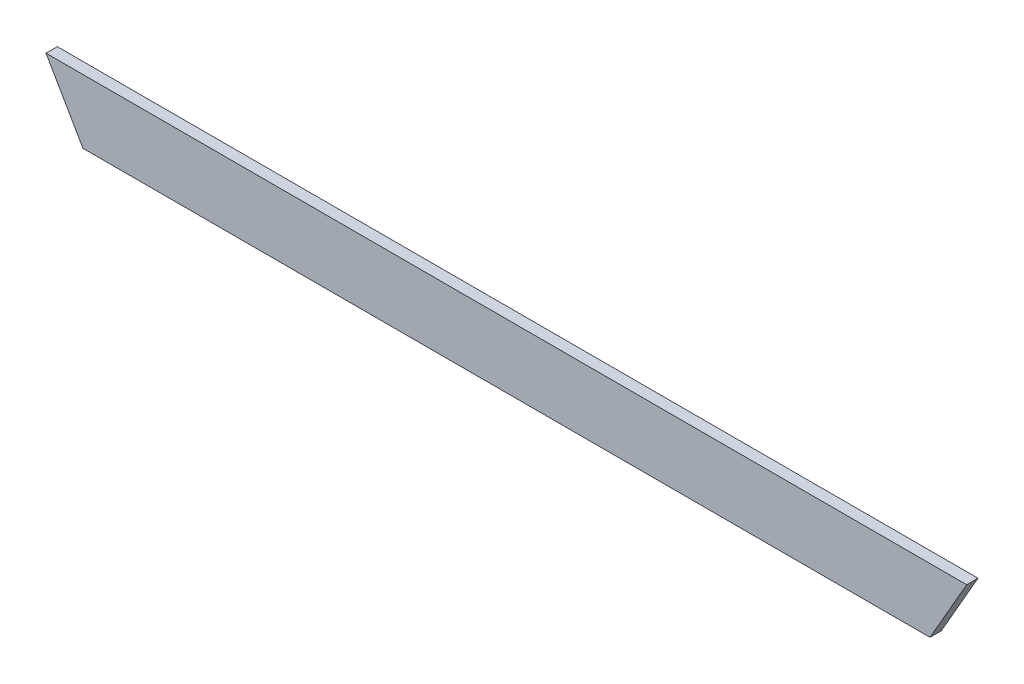
ISO-10303-21;
HEADER;
FILE_DESCRIPTION(('STEP AP214'),'2;1');
FILE_NAME('part.step','',(''),(''),'','','');
FILE_SCHEMA(('AUTOMOTIVE_DESIGN { 1 0 10303 214 1 1 1 1 }'));
ENDSEC;
DATA;
#1=APPLICATION_CONTEXT('core data for automotive mechanical design processes');
#2=APPLICATION_PROTOCOL_DEFINITION('international standard','automotive_design',2000,#1);
#3=PRODUCT_CONTEXT('',#1,'mechanical');
#4=PRODUCT('Part','Part','',(#3));
#5=PRODUCT_RELATED_PRODUCT_CATEGORY('part','',(#4));
#6=PRODUCT_DEFINITION_FORMATION('','',#4);
#7=PRODUCT_DEFINITION_CONTEXT('part definition',#1,'design');
#8=PRODUCT_DEFINITION('design','',#6,#7);
#9=PRODUCT_DEFINITION_SHAPE('','',#8);
#10=(LENGTH_UNIT() NAMED_UNIT(*) SI_UNIT(.MILLI.,.METRE.));
#11=(NAMED_UNIT(*) PLANE_ANGLE_UNIT() SI_UNIT($,.RADIAN.));
#12=(NAMED_UNIT(*) SI_UNIT($,.STERADIAN.) SOLID_ANGLE_UNIT());
#13=UNCERTAINTY_MEASURE_WITH_UNIT(LENGTH_MEASURE(1.E-05),#10,'distance_accuracy_value','');
#14=(GEOMETRIC_REPRESENTATION_CONTEXT(3) GLOBAL_UNCERTAINTY_ASSIGNED_CONTEXT((#13)) GLOBAL_UNIT_ASSIGNED_CONTEXT((#10,
#11,#12)) REPRESENTATION_CONTEXT('',''));
#15=CARTESIAN_POINT('',(0.,0.,0.));
#16=DIRECTION('',(0.,0.,1.));
#17=DIRECTION('',(1.,0.,0.));
#18=AXIS2_PLACEMENT_3D('',#15,#16,#17);
#19=CARTESIAN_POINT('',(-660.185020783291,130.622118766259,3.));
#20=DIRECTION('',(0.,-1.,0.));
#21=DIRECTION('',(1.,0.,0.));
#22=AXIS2_PLACEMENT_3D('',#19,#20,#21);
#23=PLANE('',#22);
#24=DIRECTION('',(-1.,0.,0.));
#25=VECTOR('',#24,1.);
#26=CARTESIAN_POINT('',(-660.185020783291,130.622118766259,0.));
#27=LINE('',#26,#25);
#28=CARTESIAN_POINT('',(-415.373000608799,130.622118766259,0.));
#29=VERTEX_POINT('',#28);
#30=CARTESIAN_POINT('',(-660.185020783291,130.622118766259,0.));
#31=VERTEX_POINT('',#30);
#32=EDGE_CURVE('E100',#29,#31,#27,.T.);
#33=ORIENTED_EDGE('',*,*,#32,.T.);
#34=DIRECTION('',(0.,0.,-1.));
#35=VECTOR('',#34,1.);
#36=CARTESIAN_POINT('',(-660.185020783291,130.622118766259,3.));
#37=LINE('',#36,#35);
#38=CARTESIAN_POINT('',(-660.185020783291,130.622118766259,3.));
#39=VERTEX_POINT('',#38);
#40=EDGE_CURVE('E11',#39,#31,#37,.T.);
#41=ORIENTED_EDGE('',*,*,#40,.F.);
#42=DIRECTION('',(-1.,0.,0.));
#43=VECTOR('',#42,1.);
#44=CARTESIAN_POINT('',(-660.185020783291,130.622118766259,3.));
#45=LINE('',#44,#43);
#46=CARTESIAN_POINT('',(-415.373000608799,130.622118766259,3.));
#47=VERTEX_POINT('',#46);
#48=EDGE_CURVE('E88',#47,#39,#45,.T.);
#49=ORIENTED_EDGE('',*,*,#48,.F.);
#50=DIRECTION('',(0.,0.,-1.));
#51=VECTOR('',#50,1.);
#52=CARTESIAN_POINT('',(-415.373000608799,130.622118766259,3.));
#53=LINE('',#52,#51);
#54=EDGE_CURVE('E96',#47,#29,#53,.T.);
#55=ORIENTED_EDGE('',*,*,#54,.T.);
#56=EDGE_LOOP('',(#33,#41,#49,#55));
#57=FACE_BOUND('',#56,.T.);
#58=ADVANCED_FACE('F37',(#57),#23,.F.);
#59=CARTESIAN_POINT('',(-660.185020783291,130.622118766259,3.));
#60=DIRECTION('',(0.865799017747919,0.500391907275427,0.));
#61=DIRECTION('',(-0.500391907275427,0.865799017747919,0.));
#62=AXIS2_PLACEMENT_3D('',#59,#60,#61);
#63=PLANE('',#62);
#64=DIRECTION('',(0.500391907275427,-0.865799017747918,0.));
#65=VECTOR('',#64,1.);
#66=CARTESIAN_POINT('',(-660.185020783291,130.622118766259,0.));
#67=LINE('',#66,#65);
#68=CARTESIAN_POINT('',(-650.360564602325,113.623433560294,0.));
#69=VERTEX_POINT('',#68);
#70=EDGE_CURVE('E92',#31,#69,#67,.T.);
#71=ORIENTED_EDGE('',*,*,#70,.T.);
#72=DIRECTION('',(0.,0.,-1.));
#73=VECTOR('',#72,1.);
#74=CARTESIAN_POINT('',(-650.360564602325,113.623433560294,3.));
#75=LINE('',#74,#73);
#76=CARTESIAN_POINT('',(-650.360564602325,113.623433560294,3.));
#77=VERTEX_POINT('',#76);
#78=EDGE_CURVE('E45',#77,#69,#75,.T.);
#79=ORIENTED_EDGE('',*,*,#78,.F.);
#80=DIRECTION('',(0.500391907275427,-0.865799017747918,0.));
#81=VECTOR('',#80,1.);
#82=CARTESIAN_POINT('',(-660.185020783291,130.622118766259,3.));
#83=LINE('',#82,#81);
#84=EDGE_CURVE('E83',#39,#77,#83,.T.);
#85=ORIENTED_EDGE('',*,*,#84,.F.);
#86=ORIENTED_EDGE('',*,*,#40,.T.);
#87=EDGE_LOOP('',(#71,#79,#85,#86));
#88=FACE_BOUND('',#87,.T.);
#89=ADVANCED_FACE('F91',(#88),#63,.F.);
#90=CARTESIAN_POINT('',(-425.139630486348,113.623433560294,3.));
#91=DIRECTION('',(0.,1.,0.));
#92=DIRECTION('',(-1.,0.,0.));
#93=AXIS2_PLACEMENT_3D('',#90,#91,#92);
#94=PLANE('',#93);
#95=DIRECTION('',(1.,0.,0.));
#96=VECTOR('',#95,1.);
#97=CARTESIAN_POINT('',(-425.139630486348,113.623433560294,0.));
#98=LINE('',#97,#96);
#99=CARTESIAN_POINT('',(-425.139630486348,113.623433560294,0.));
#100=VERTEX_POINT('',#99);
#101=EDGE_CURVE('E70',#69,#100,#98,.T.);
#102=ORIENTED_EDGE('',*,*,#101,.T.);
#103=DIRECTION('',(0.,0.,-1.));
#104=VECTOR('',#103,1.);
#105=CARTESIAN_POINT('',(-425.139630486348,113.623433560294,3.));
#106=LINE('',#105,#104);
#107=CARTESIAN_POINT('',(-425.139630486348,113.623433560294,3.));
#108=VERTEX_POINT('',#107);
#109=EDGE_CURVE('E93',#108,#100,#106,.T.);
#110=ORIENTED_EDGE('',*,*,#109,.F.);
#111=DIRECTION('',(1.,0.,0.));
#112=VECTOR('',#111,1.);
#113=CARTESIAN_POINT('',(-425.139630486348,113.623433560294,3.));
#114=LINE('',#113,#112);
#115=EDGE_CURVE('E86',#77,#108,#114,.T.);
#116=ORIENTED_EDGE('',*,*,#115,.F.);
#117=ORIENTED_EDGE('',*,*,#78,.T.);
#118=EDGE_LOOP('',(#102,#110,#116,#117));
#119=FACE_BOUND('',#118,.T.);
#120=ADVANCED_FACE('F94',(#119),#94,.F.);
#121=CARTESIAN_POINT('',(-415.373000608799,130.622118766259,3.));
#122=DIRECTION('',(-0.867074085052372,0.498179215775399,0.));
#123=DIRECTION('',(-0.498179215775399,-0.867074085052372,0.));
#124=AXIS2_PLACEMENT_3D('',#121,#122,#123);
#125=PLANE('',#124);
#126=DIRECTION('',(0.498179215775399,0.867074085052372,0.));
#127=VECTOR('',#126,1.);
#128=CARTESIAN_POINT('',(-415.373000608799,130.622118766259,0.));
#129=LINE('',#128,#127);
#130=EDGE_CURVE('E76',#100,#29,#129,.T.);
#131=ORIENTED_EDGE('',*,*,#130,.T.);
#132=ORIENTED_EDGE('',*,*,#54,.F.);
#133=DIRECTION('',(0.498179215775399,0.867074085052372,0.));
#134=VECTOR('',#133,1.);
#135=CARTESIAN_POINT('',(-415.373000608799,130.622118766259,3.));
#136=LINE('',#135,#134);
#137=EDGE_CURVE('E53',#108,#47,#136,.T.);
#138=ORIENTED_EDGE('',*,*,#137,.F.);
#139=ORIENTED_EDGE('',*,*,#109,.T.);
#140=EDGE_LOOP('',(#131,#132,#138,#139));
#141=FACE_BOUND('',#140,.T.);
#142=ADVANCED_FACE('F107',(#141),#125,.F.);
#143=CARTESIAN_POINT('',(0.,0.,3.));
#144=DIRECTION('',(0.,0.,-1.));
#145=DIRECTION('',(-1.,0.,0.));
#146=AXIS2_PLACEMENT_3D('',#143,#144,#145);
#147=PLANE('',#146);
#148=ORIENTED_EDGE('',*,*,#48,.T.);
#149=ORIENTED_EDGE('',*,*,#84,.T.);
#150=ORIENTED_EDGE('',*,*,#115,.T.);
#151=ORIENTED_EDGE('',*,*,#137,.T.);
#152=EDGE_LOOP('',(#148,#149,#150,#151));
#153=FACE_BOUND('',#152,.T.);
#154=ADVANCED_FACE('F84',(#153),#147,.F.);
#155=CARTESIAN_POINT('',(0.,0.,0.));
#156=DIRECTION('',(0.,0.,-1.));
#157=DIRECTION('',(-1.,0.,0.));
#158=AXIS2_PLACEMENT_3D('',#155,#156,#157);
#159=PLANE('',#158);
#160=ORIENTED_EDGE('',*,*,#32,.F.);
#161=ORIENTED_EDGE('',*,*,#130,.F.);
#162=ORIENTED_EDGE('',*,*,#101,.F.);
#163=ORIENTED_EDGE('',*,*,#70,.F.);
#164=EDGE_LOOP('',(#160,#161,#162,#163));
#165=FACE_BOUND('',#164,.T.);
#166=ADVANCED_FACE('F110',(#165),#159,.T.);
#167=CLOSED_SHELL('',(#58,#89,#120,#142,#154,#166));
#168=MANIFOLD_SOLID_BREP('B2',#167);
#169=ADVANCED_BREP_SHAPE_REPRESENTATION('',(#18,#168),#14);
#170=SHAPE_DEFINITION_REPRESENTATION(#9,#169);
ENDSEC;
END-ISO-10303-21;
